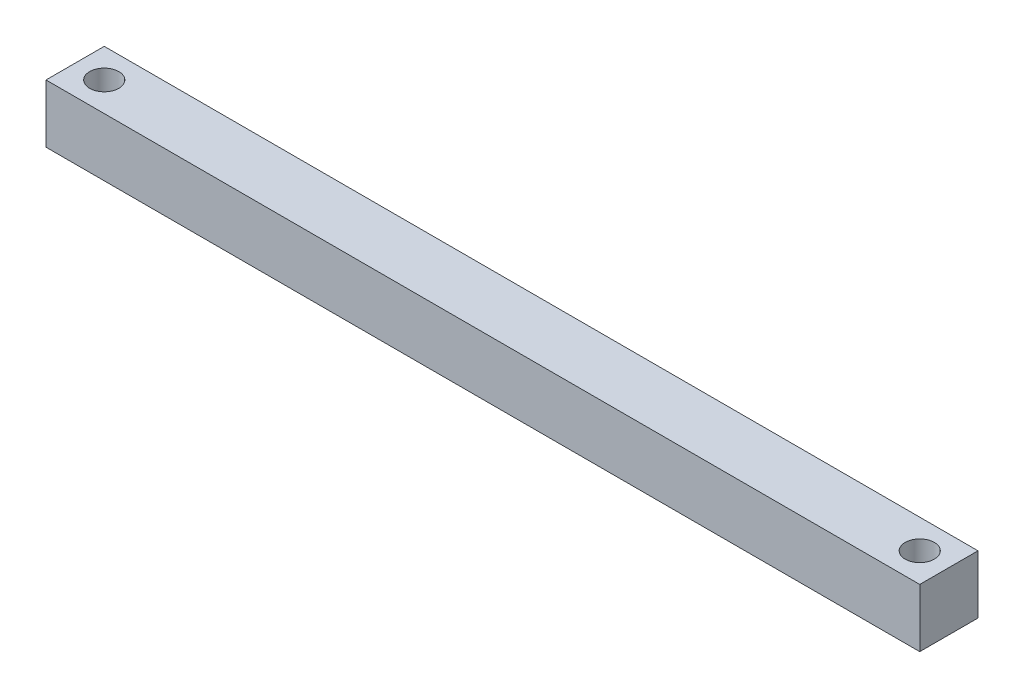
ISO-10303-21;
HEADER;
FILE_DESCRIPTION(('STEP AP214'),'2;1');
FILE_NAME('part.step','',(''),(''),'','','');
FILE_SCHEMA(('AUTOMOTIVE_DESIGN { 1 0 10303 214 1 1 1 1 }'));
ENDSEC;
DATA;
#1=APPLICATION_CONTEXT('core data for automotive mechanical design processes');
#2=APPLICATION_PROTOCOL_DEFINITION('international standard','automotive_design',2000,#1);
#3=PRODUCT_CONTEXT('',#1,'mechanical');
#4=PRODUCT('Part','Part','',(#3));
#5=PRODUCT_RELATED_PRODUCT_CATEGORY('part','',(#4));
#6=PRODUCT_DEFINITION_FORMATION('','',#4);
#7=PRODUCT_DEFINITION_CONTEXT('part definition',#1,'design');
#8=PRODUCT_DEFINITION('design','',#6,#7);
#9=PRODUCT_DEFINITION_SHAPE('','',#8);
#10=(LENGTH_UNIT() NAMED_UNIT(*) SI_UNIT(.MILLI.,.METRE.));
#11=(NAMED_UNIT(*) PLANE_ANGLE_UNIT() SI_UNIT($,.RADIAN.));
#12=(NAMED_UNIT(*) SI_UNIT($,.STERADIAN.) SOLID_ANGLE_UNIT());
#13=UNCERTAINTY_MEASURE_WITH_UNIT(LENGTH_MEASURE(1.E-05),#10,'distance_accuracy_value','');
#14=(GEOMETRIC_REPRESENTATION_CONTEXT(3) GLOBAL_UNCERTAINTY_ASSIGNED_CONTEXT((#13)) GLOBAL_UNIT_ASSIGNED_CONTEXT((#10,
#11,#12)) REPRESENTATION_CONTEXT('',''));
#15=CARTESIAN_POINT('',(0.,0.,0.));
#16=DIRECTION('',(0.,0.,1.));
#17=DIRECTION('',(1.,0.,0.));
#18=AXIS2_PLACEMENT_3D('',#15,#16,#17);
#19=CARTESIAN_POINT('',(381.,0.,0.));
#20=DIRECTION('',(0.,0.,1.));
#21=DIRECTION('',(1.,0.,0.));
#22=AXIS2_PLACEMENT_3D('',#19,#20,#21);
#23=PLANE('',#22);
#24=DIRECTION('',(0.,1.,0.));
#25=VECTOR('',#24,1.);
#26=CARTESIAN_POINT('',(0.,0.,0.));
#27=LINE('',#26,#25);
#28=CARTESIAN_POINT('',(0.,0.,0.));
#29=VERTEX_POINT('',#28);
#30=CARTESIAN_POINT('',(0.,25.4,0.));
#31=VERTEX_POINT('',#30);
#32=EDGE_CURVE('E96',#29,#31,#27,.T.);
#33=ORIENTED_EDGE('',*,*,#32,.T.);
#34=DIRECTION('',(-1.,0.,0.));
#35=VECTOR('',#34,1.);
#36=CARTESIAN_POINT('',(381.,25.4,0.));
#37=LINE('',#36,#35);
#38=CARTESIAN_POINT('',(381.,25.4,0.));
#39=VERTEX_POINT('',#38);
#40=EDGE_CURVE('E11',#39,#31,#37,.T.);
#41=ORIENTED_EDGE('',*,*,#40,.F.);
#42=DIRECTION('',(0.,1.,0.));
#43=VECTOR('',#42,1.);
#44=CARTESIAN_POINT('',(381.,0.,0.));
#45=LINE('',#44,#43);
#46=CARTESIAN_POINT('',(381.,0.,0.));
#47=VERTEX_POINT('',#46);
#48=EDGE_CURVE('E84',#47,#39,#45,.T.);
#49=ORIENTED_EDGE('',*,*,#48,.F.);
#50=DIRECTION('',(-1.,0.,0.));
#51=VECTOR('',#50,1.);
#52=CARTESIAN_POINT('',(381.,0.,0.));
#53=LINE('',#52,#51);
#54=EDGE_CURVE('E92',#47,#29,#53,.T.);
#55=ORIENTED_EDGE('',*,*,#54,.T.);
#56=EDGE_LOOP('',(#33,#41,#49,#55));
#57=FACE_BOUND('',#56,.T.);
#58=ADVANCED_FACE('F33',(#57),#23,.F.);
#59=CARTESIAN_POINT('',(381.,25.4,0.));
#60=DIRECTION('',(0.,-1.,0.));
#61=DIRECTION('',(0.,0.,-1.));
#62=AXIS2_PLACEMENT_3D('',#59,#60,#61);
#63=PLANE('',#62);
#64=CARTESIAN_POINT('',(12.7,25.4,12.7));
#65=DIRECTION('',(0.,1.,0.));
#66=DIRECTION('',(0.,0.,1.));
#67=AXIS2_PLACEMENT_3D('',#64,#65,#66);
#68=CIRCLE('',#67,6.35);
#69=CARTESIAN_POINT('',(12.7,25.4,19.05));
#70=VERTEX_POINT('',#69);
#71=EDGE_CURVE('E116',#70,#70,#68,.T.);
#72=ORIENTED_EDGE('',*,*,#71,.F.);
#73=EDGE_LOOP('',(#72));
#74=FACE_BOUND('',#73,.T.);
#75=CARTESIAN_POINT('',(368.3,25.4,12.7));
#76=DIRECTION('',(0.,1.,0.));
#77=DIRECTION('',(0.,0.,1.));
#78=AXIS2_PLACEMENT_3D('',#75,#76,#77);
#79=CIRCLE('',#78,6.35);
#80=CARTESIAN_POINT('',(368.3,25.4,19.05));
#81=VERTEX_POINT('',#80);
#82=EDGE_CURVE('E110',#81,#81,#79,.T.);
#83=ORIENTED_EDGE('',*,*,#82,.F.);
#84=EDGE_LOOP('',(#83));
#85=FACE_BOUND('',#84,.T.);
#86=DIRECTION('',(0.,0.,1.));
#87=VECTOR('',#86,1.);
#88=CARTESIAN_POINT('',(0.,25.4,0.));
#89=LINE('',#88,#87);
#90=CARTESIAN_POINT('',(0.,25.4,25.4));
#91=VERTEX_POINT('',#90);
#92=EDGE_CURVE('E88',#31,#91,#89,.T.);
#93=ORIENTED_EDGE('',*,*,#92,.T.);
#94=DIRECTION('',(-1.,0.,0.));
#95=VECTOR('',#94,1.);
#96=CARTESIAN_POINT('',(381.,25.4,25.4));
#97=LINE('',#96,#95);
#98=CARTESIAN_POINT('',(381.,25.4,25.4));
#99=VERTEX_POINT('',#98);
#100=EDGE_CURVE('E41',#99,#91,#97,.T.);
#101=ORIENTED_EDGE('',*,*,#100,.F.);
#102=DIRECTION('',(0.,0.,1.));
#103=VECTOR('',#102,1.);
#104=CARTESIAN_POINT('',(381.,25.4,0.));
#105=LINE('',#104,#103);
#106=EDGE_CURVE('E79',#39,#99,#105,.T.);
#107=ORIENTED_EDGE('',*,*,#106,.F.);
#108=ORIENTED_EDGE('',*,*,#40,.T.);
#109=EDGE_LOOP('',(#93,#101,#107,#108));
#110=FACE_BOUND('',#109,.T.);
#111=ADVANCED_FACE('F87',(#74,#85,#110),#63,.F.);
#112=CARTESIAN_POINT('',(381.,0.,25.4));
#113=DIRECTION('',(0.,0.,-1.));
#114=DIRECTION('',(-1.,0.,0.));
#115=AXIS2_PLACEMENT_3D('',#112,#113,#114);
#116=PLANE('',#115);
#117=DIRECTION('',(0.,-1.,0.));
#118=VECTOR('',#117,1.);
#119=CARTESIAN_POINT('',(0.,0.,25.4));
#120=LINE('',#119,#118);
#121=CARTESIAN_POINT('',(0.,0.,25.4));
#122=VERTEX_POINT('',#121);
#123=EDGE_CURVE('E66',#91,#122,#120,.T.);
#124=ORIENTED_EDGE('',*,*,#123,.T.);
#125=DIRECTION('',(-1.,0.,0.));
#126=VECTOR('',#125,1.);
#127=CARTESIAN_POINT('',(381.,0.,25.4));
#128=LINE('',#127,#126);
#129=CARTESIAN_POINT('',(381.,0.,25.4));
#130=VERTEX_POINT('',#129);
#131=EDGE_CURVE('E89',#130,#122,#128,.T.);
#132=ORIENTED_EDGE('',*,*,#131,.F.);
#133=DIRECTION('',(0.,-1.,0.));
#134=VECTOR('',#133,1.);
#135=CARTESIAN_POINT('',(381.,0.,25.4));
#136=LINE('',#135,#134);
#137=EDGE_CURVE('E82',#99,#130,#136,.T.);
#138=ORIENTED_EDGE('',*,*,#137,.F.);
#139=ORIENTED_EDGE('',*,*,#100,.T.);
#140=EDGE_LOOP('',(#124,#132,#138,#139));
#141=FACE_BOUND('',#140,.T.);
#142=ADVANCED_FACE('F90',(#141),#116,.F.);
#143=CARTESIAN_POINT('',(381.,0.,0.));
#144=DIRECTION('',(0.,1.,0.));
#145=DIRECTION('',(0.,0.,1.));
#146=AXIS2_PLACEMENT_3D('',#143,#144,#145);
#147=PLANE('',#146);
#148=CARTESIAN_POINT('',(12.7,0.,12.7));
#149=DIRECTION('',(0.,1.,0.));
#150=DIRECTION('',(0.,0.,1.));
#151=AXIS2_PLACEMENT_3D('',#148,#149,#150);
#152=CIRCLE('',#151,6.35);
#153=CARTESIAN_POINT('',(12.7,0.,19.05));
#154=VERTEX_POINT('',#153);
#155=EDGE_CURVE('E113',#154,#154,#152,.T.);
#156=ORIENTED_EDGE('',*,*,#155,.T.);
#157=EDGE_LOOP('',(#156));
#158=FACE_BOUND('',#157,.T.);
#159=CARTESIAN_POINT('',(368.3,0.,12.7));
#160=DIRECTION('',(0.,1.,0.));
#161=DIRECTION('',(0.,0.,1.));
#162=AXIS2_PLACEMENT_3D('',#159,#160,#161);
#163=CIRCLE('',#162,6.35);
#164=CARTESIAN_POINT('',(368.3,0.,19.05));
#165=VERTEX_POINT('',#164);
#166=EDGE_CURVE('E99',#165,#165,#163,.T.);
#167=ORIENTED_EDGE('',*,*,#166,.T.);
#168=EDGE_LOOP('',(#167));
#169=FACE_BOUND('',#168,.T.);
#170=DIRECTION('',(0.,0.,-1.));
#171=VECTOR('',#170,1.);
#172=CARTESIAN_POINT('',(0.,0.,0.));
#173=LINE('',#172,#171);
#174=EDGE_CURVE('E72',#122,#29,#173,.T.);
#175=ORIENTED_EDGE('',*,*,#174,.T.);
#176=ORIENTED_EDGE('',*,*,#54,.F.);
#177=DIRECTION('',(0.,0.,-1.));
#178=VECTOR('',#177,1.);
#179=CARTESIAN_POINT('',(381.,0.,0.));
#180=LINE('',#179,#178);
#181=EDGE_CURVE('E49',#130,#47,#180,.T.);
#182=ORIENTED_EDGE('',*,*,#181,.F.);
#183=ORIENTED_EDGE('',*,*,#131,.T.);
#184=EDGE_LOOP('',(#175,#176,#182,#183));
#185=FACE_BOUND('',#184,.T.);
#186=ADVANCED_FACE('F104',(#158,#169,#185),#147,.F.);
#187=CARTESIAN_POINT('',(381.,0.,0.));
#188=DIRECTION('',(1.,0.,0.));
#189=DIRECTION('',(0.,0.,-1.));
#190=AXIS2_PLACEMENT_3D('',#187,#188,#189);
#191=PLANE('',#190);
#192=ORIENTED_EDGE('',*,*,#48,.T.);
#193=ORIENTED_EDGE('',*,*,#106,.T.);
#194=ORIENTED_EDGE('',*,*,#137,.T.);
#195=ORIENTED_EDGE('',*,*,#181,.T.);
#196=EDGE_LOOP('',(#192,#193,#194,#195));
#197=FACE_BOUND('',#196,.T.);
#198=ADVANCED_FACE('F80',(#197),#191,.T.);
#199=CARTESIAN_POINT('',(0.,0.,0.));
#200=DIRECTION('',(1.,0.,0.));
#201=DIRECTION('',(0.,0.,-1.));
#202=AXIS2_PLACEMENT_3D('',#199,#200,#201);
#203=PLANE('',#202);
#204=ORIENTED_EDGE('',*,*,#32,.F.);
#205=ORIENTED_EDGE('',*,*,#174,.F.);
#206=ORIENTED_EDGE('',*,*,#123,.F.);
#207=ORIENTED_EDGE('',*,*,#92,.F.);
#208=EDGE_LOOP('',(#204,#205,#206,#207));
#209=FACE_BOUND('',#208,.T.);
#210=ADVANCED_FACE('F107',(#209),#203,.F.);
#211=CARTESIAN_POINT('',(368.3,0.,12.7));
#212=DIRECTION('',(0.,1.,0.));
#213=DIRECTION('',(0.,0.,1.));
#214=AXIS2_PLACEMENT_3D('',#211,#212,#213);
#215=CYLINDRICAL_SURFACE('',#214,6.35);
#216=ORIENTED_EDGE('',*,*,#166,.F.);
#217=EDGE_LOOP('',(#216));
#218=FACE_BOUND('',#217,.T.);
#219=ORIENTED_EDGE('',*,*,#82,.T.);
#220=EDGE_LOOP('',(#219));
#221=FACE_BOUND('',#220,.T.);
#222=ADVANCED_FACE('F127',(#218,#221),#215,.F.);
#223=CARTESIAN_POINT('',(12.7,0.,12.7));
#224=DIRECTION('',(0.,1.,0.));
#225=DIRECTION('',(0.,0.,1.));
#226=AXIS2_PLACEMENT_3D('',#223,#224,#225);
#227=CYLINDRICAL_SURFACE('',#226,6.35);
#228=ORIENTED_EDGE('',*,*,#155,.F.);
#229=EDGE_LOOP('',(#228));
#230=FACE_BOUND('',#229,.T.);
#231=ORIENTED_EDGE('',*,*,#71,.T.);
#232=EDGE_LOOP('',(#231));
#233=FACE_BOUND('',#232,.T.);
#234=ADVANCED_FACE('F124',(#230,#233),#227,.F.);
#235=CLOSED_SHELL('',(#58,#111,#142,#186,#198,#210,#222,#234));
#236=MANIFOLD_SOLID_BREP('B2',#235);
#237=ADVANCED_BREP_SHAPE_REPRESENTATION('',(#18,#236),#14);
#238=SHAPE_DEFINITION_REPRESENTATION(#9,#237);
ENDSEC;
END-ISO-10303-21;
